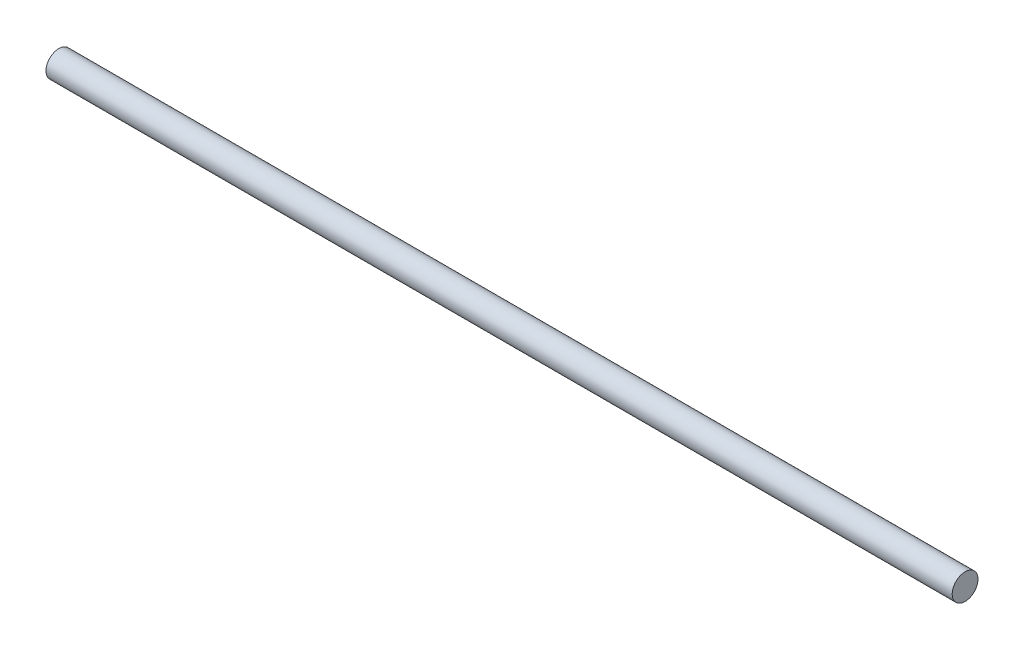
ISO-10303-21;
HEADER;
FILE_DESCRIPTION(('STEP AP214'),'2;1');
FILE_NAME('part.step','',(''),(''),'','','');
FILE_SCHEMA(('AUTOMOTIVE_DESIGN { 1 0 10303 214 1 1 1 1 }'));
ENDSEC;
DATA;
#1=APPLICATION_CONTEXT('core data for automotive mechanical design processes');
#2=APPLICATION_PROTOCOL_DEFINITION('international standard','automotive_design',2000,#1);
#3=PRODUCT_CONTEXT('',#1,'mechanical');
#4=PRODUCT('Part','Part','',(#3));
#5=PRODUCT_RELATED_PRODUCT_CATEGORY('part','',(#4));
#6=PRODUCT_DEFINITION_FORMATION('','',#4);
#7=PRODUCT_DEFINITION_CONTEXT('part definition',#1,'design');
#8=PRODUCT_DEFINITION('design','',#6,#7);
#9=PRODUCT_DEFINITION_SHAPE('','',#8);
#10=(LENGTH_UNIT() NAMED_UNIT(*) SI_UNIT(.MILLI.,.METRE.));
#11=(NAMED_UNIT(*) PLANE_ANGLE_UNIT() SI_UNIT($,.RADIAN.));
#12=(NAMED_UNIT(*) SI_UNIT($,.STERADIAN.) SOLID_ANGLE_UNIT());
#13=UNCERTAINTY_MEASURE_WITH_UNIT(LENGTH_MEASURE(1.E-05),#10,'distance_accuracy_value','');
#14=(GEOMETRIC_REPRESENTATION_CONTEXT(3) GLOBAL_UNCERTAINTY_ASSIGNED_CONTEXT((#13)) GLOBAL_UNIT_ASSIGNED_CONTEXT((#10,
#11,#12)) REPRESENTATION_CONTEXT('',''));
#15=CARTESIAN_POINT('',(0.,0.,0.));
#16=DIRECTION('',(0.,0.,1.));
#17=DIRECTION('',(1.,0.,0.));
#18=AXIS2_PLACEMENT_3D('',#15,#16,#17);
#19=CARTESIAN_POINT('',(139.421696681123,2.70798729366106,-1.62924388689589));
#20=DIRECTION('',(-1.,0.,0.));
#21=DIRECTION('',(0.,0.,1.));
#22=AXIS2_PLACEMENT_3D('',#19,#20,#21);
#23=CYLINDRICAL_SURFACE('',#22,4.);
#24=CARTESIAN_POINT('',(139.421696681123,2.70798729366106,-1.62924388689589));
#25=DIRECTION('',(1.,0.,0.));
#26=DIRECTION('',(0.,0.,-1.));
#27=AXIS2_PLACEMENT_3D('',#24,#25,#26);
#28=CIRCLE('',#27,4.);
#29=CARTESIAN_POINT('',(139.421696681123,2.70798729366106,-5.62924388689589));
#30=VERTEX_POINT('',#29);
#31=EDGE_CURVE('E9',#30,#30,#28,.T.);
#32=ORIENTED_EDGE('',*,*,#31,.F.);
#33=EDGE_LOOP('',(#32));
#34=FACE_BOUND('',#33,.T.);
#35=CARTESIAN_POINT('',(-141.578303318877,2.70798729366106,-1.62924388689589));
#36=DIRECTION('',(1.,0.,0.));
#37=DIRECTION('',(0.,0.,-1.));
#38=AXIS2_PLACEMENT_3D('',#35,#36,#37);
#39=CIRCLE('',#38,4.);
#40=CARTESIAN_POINT('',(-141.578303318877,2.70798729366106,-5.62924388689589));
#41=VERTEX_POINT('',#40);
#42=EDGE_CURVE('E17',#41,#41,#39,.T.);
#43=ORIENTED_EDGE('',*,*,#42,.T.);
#44=EDGE_LOOP('',(#43));
#45=FACE_BOUND('',#44,.T.);
#46=ADVANCED_FACE('F14',(#34,#45),#23,.T.);
#47=CARTESIAN_POINT('',(139.421696681123,2.70798729366106,-1.62924388689589));
#48=DIRECTION('',(1.,0.,0.));
#49=DIRECTION('',(0.,0.,-1.));
#50=AXIS2_PLACEMENT_3D('',#47,#48,#49);
#51=PLANE('',#50);
#52=ORIENTED_EDGE('',*,*,#31,.T.);
#53=EDGE_LOOP('',(#52));
#54=FACE_BOUND('',#53,.T.);
#55=ADVANCED_FACE('F29',(#54),#51,.T.);
#56=CARTESIAN_POINT('',(-141.578303318877,2.70798729366106,-1.62924388689589));
#57=DIRECTION('',(1.,0.,0.));
#58=DIRECTION('',(0.,0.,-1.));
#59=AXIS2_PLACEMENT_3D('',#56,#57,#58);
#60=PLANE('',#59);
#61=ORIENTED_EDGE('',*,*,#42,.F.);
#62=EDGE_LOOP('',(#61));
#63=FACE_BOUND('',#62,.T.);
#64=ADVANCED_FACE('F27',(#63),#60,.F.);
#65=CLOSED_SHELL('',(#46,#55,#64));
#66=MANIFOLD_SOLID_BREP('B1',#65);
#67=ADVANCED_BREP_SHAPE_REPRESENTATION('',(#18,#66),#14);
#68=SHAPE_DEFINITION_REPRESENTATION(#9,#67);
ENDSEC;
END-ISO-10303-21;
